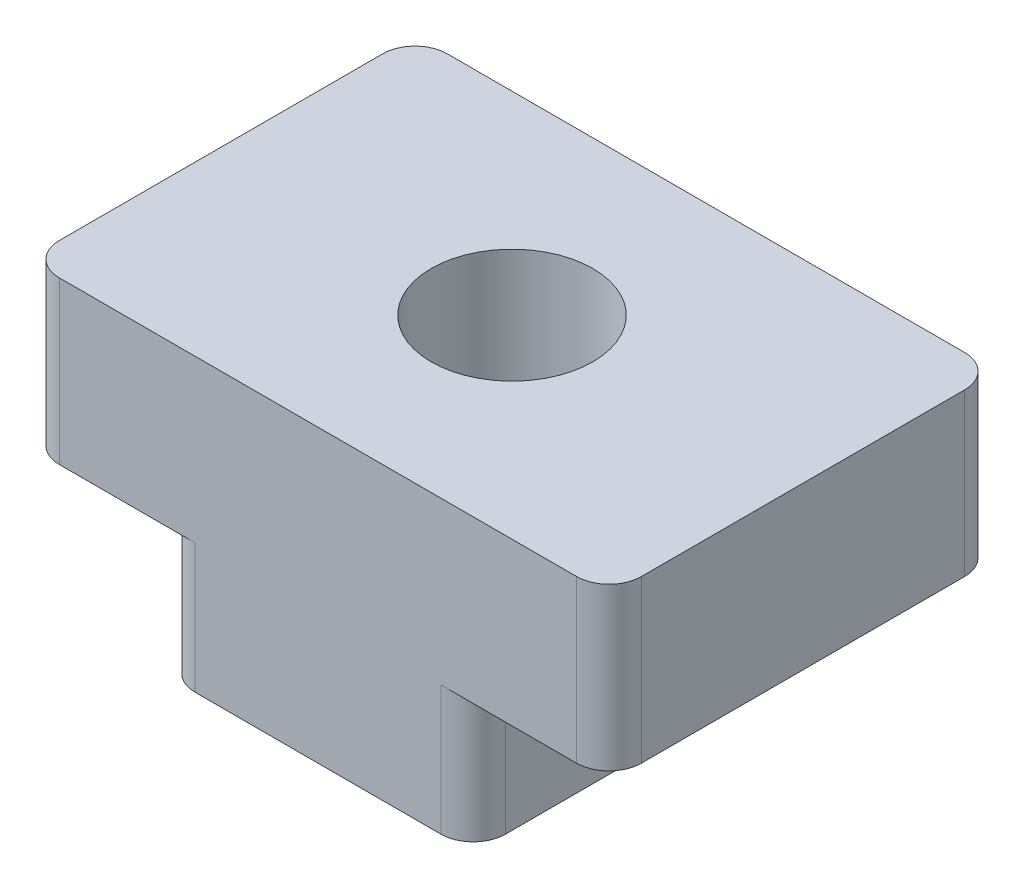
ISO-10303-21;
HEADER;
FILE_DESCRIPTION(('STEP AP214'),'2;1');
FILE_NAME('part.step','',(''),(''),'','','');
FILE_SCHEMA(('AUTOMOTIVE_DESIGN { 1 0 10303 214 1 1 1 1 }'));
ENDSEC;
DATA;
#1=APPLICATION_CONTEXT('core data for automotive mechanical design processes');
#2=APPLICATION_PROTOCOL_DEFINITION('international standard','automotive_design',2000,#1);
#3=PRODUCT_CONTEXT('',#1,'mechanical');
#4=PRODUCT('Part','Part','',(#3));
#5=PRODUCT_RELATED_PRODUCT_CATEGORY('part','',(#4));
#6=PRODUCT_DEFINITION_FORMATION('','',#4);
#7=PRODUCT_DEFINITION_CONTEXT('part definition',#1,'design');
#8=PRODUCT_DEFINITION('design','',#6,#7);
#9=PRODUCT_DEFINITION_SHAPE('','',#8);
#10=(LENGTH_UNIT() NAMED_UNIT(*) SI_UNIT(.MILLI.,.METRE.));
#11=(NAMED_UNIT(*) PLANE_ANGLE_UNIT() SI_UNIT($,.RADIAN.));
#12=(NAMED_UNIT(*) SI_UNIT($,.STERADIAN.) SOLID_ANGLE_UNIT());
#13=UNCERTAINTY_MEASURE_WITH_UNIT(LENGTH_MEASURE(1.E-05),#10,'distance_accuracy_value','');
#14=(GEOMETRIC_REPRESENTATION_CONTEXT(3) GLOBAL_UNCERTAINTY_ASSIGNED_CONTEXT((#13)) GLOBAL_UNIT_ASSIGNED_CONTEXT((#10,
#11,#12)) REPRESENTATION_CONTEXT('',''));
#15=CARTESIAN_POINT('',(0.,0.,0.));
#16=DIRECTION('',(0.,0.,1.));
#17=DIRECTION('',(1.,0.,0.));
#18=AXIS2_PLACEMENT_3D('',#15,#16,#17);
#19=CARTESIAN_POINT('',(4.5,0.,3.));
#20=DIRECTION('',(-1.,0.,0.));
#21=DIRECTION('',(0.,0.,1.));
#22=AXIS2_PLACEMENT_3D('',#19,#20,#21);
#23=PLANE('',#22);
#24=DIRECTION('',(0.,0.,-1.));
#25=VECTOR('',#24,1.);
#26=CARTESIAN_POINT('',(4.5,2.5,3.));
#27=LINE('',#26,#25);
#28=CARTESIAN_POINT('',(4.5,2.5,2.5));
#29=VERTEX_POINT('',#28);
#30=CARTESIAN_POINT('',(4.5,2.5,-2.5));
#31=VERTEX_POINT('',#30);
#32=EDGE_CURVE('E185',#29,#31,#27,.T.);
#33=ORIENTED_EDGE('',*,*,#32,.F.);
#34=DIRECTION('',(0.,1.,0.));
#35=VECTOR('',#34,1.);
#36=CARTESIAN_POINT('',(4.5,0.,2.5));
#37=LINE('',#36,#35);
#38=CARTESIAN_POINT('',(4.5,0.,2.5));
#39=VERTEX_POINT('',#38);
#40=EDGE_CURVE('E70',#29,#39,#37,.F.);
#41=ORIENTED_EDGE('',*,*,#40,.T.);
#42=DIRECTION('',(0.,0.,-1.));
#43=VECTOR('',#42,1.);
#44=CARTESIAN_POINT('',(4.5,0.,3.));
#45=LINE('',#44,#43);
#46=CARTESIAN_POINT('',(4.5,0.,-2.5));
#47=VERTEX_POINT('',#46);
#48=EDGE_CURVE('E213',#39,#47,#45,.T.);
#49=ORIENTED_EDGE('',*,*,#48,.T.);
#50=DIRECTION('',(0.,1.,0.));
#51=VECTOR('',#50,1.);
#52=CARTESIAN_POINT('',(4.5,2.5,-2.5));
#53=LINE('',#52,#51);
#54=EDGE_CURVE('E318',#47,#31,#53,.T.);
#55=ORIENTED_EDGE('',*,*,#54,.T.);
#56=EDGE_LOOP('',(#33,#41,#49,#55));
#57=FACE_BOUND('',#56,.T.);
#58=ADVANCED_FACE('F47',(#57),#23,.F.);
#59=CARTESIAN_POINT('',(-4.5,2.5,3.));
#60=DIRECTION('',(0.,-1.,0.));
#61=DIRECTION('',(0.,0.,-1.));
#62=AXIS2_PLACEMENT_3D('',#59,#60,#61);
#63=PLANE('',#62);
#64=CARTESIAN_POINT('',(0.,2.5,0.));
#65=DIRECTION('',(0.,1.,0.));
#66=DIRECTION('',(0.,0.,1.));
#67=AXIS2_PLACEMENT_3D('',#64,#65,#66);
#68=CIRCLE('',#67,1.25);
#69=CARTESIAN_POINT('',(0.,2.5,1.25));
#70=VERTEX_POINT('',#69);
#71=EDGE_CURVE('E205',#70,#70,#68,.T.);
#72=ORIENTED_EDGE('',*,*,#71,.F.);
#73=EDGE_LOOP('',(#72));
#74=FACE_BOUND('',#73,.T.);
#75=DIRECTION('',(0.,0.,-1.));
#76=VECTOR('',#75,1.);
#77=CARTESIAN_POINT('',(-4.5,2.5,3.));
#78=LINE('',#77,#76);
#79=CARTESIAN_POINT('',(-4.5,2.5,2.5));
#80=VERTEX_POINT('',#79);
#81=CARTESIAN_POINT('',(-4.5,2.5,-2.5));
#82=VERTEX_POINT('',#81);
#83=EDGE_CURVE('E246',#80,#82,#78,.T.);
#84=ORIENTED_EDGE('',*,*,#83,.F.);
#85=CARTESIAN_POINT('',(-4.,2.5,2.5));
#86=DIRECTION('',(0.,-1.,0.));
#87=DIRECTION('',(0.,0.,-1.));
#88=AXIS2_PLACEMENT_3D('',#85,#86,#87);
#89=CIRCLE('',#88,0.5);
#90=CARTESIAN_POINT('',(-4.,2.5,3.));
#91=VERTEX_POINT('',#90);
#92=EDGE_CURVE('E190',#80,#91,#89,.F.);
#93=ORIENTED_EDGE('',*,*,#92,.T.);
#94=DIRECTION('',(-1.,0.,0.));
#95=VECTOR('',#94,1.);
#96=CARTESIAN_POINT('',(-4.5,2.5,3.));
#97=LINE('',#96,#95);
#98=CARTESIAN_POINT('',(4.,2.5,3.));
#99=VERTEX_POINT('',#98);
#100=EDGE_CURVE('E179',#99,#91,#97,.T.);
#101=ORIENTED_EDGE('',*,*,#100,.F.);
#102=CARTESIAN_POINT('',(4.,2.5,2.5));
#103=DIRECTION('',(0.,-1.,0.));
#104=DIRECTION('',(0.,0.,-1.));
#105=AXIS2_PLACEMENT_3D('',#102,#103,#104);
#106=CIRCLE('',#105,0.5);
#107=EDGE_CURVE('E162',#99,#29,#106,.F.);
#108=ORIENTED_EDGE('',*,*,#107,.T.);
#109=ORIENTED_EDGE('',*,*,#32,.T.);
#110=CARTESIAN_POINT('',(4.,2.5,-2.5));
#111=DIRECTION('',(0.,-1.,0.));
#112=DIRECTION('',(0.,0.,-1.));
#113=AXIS2_PLACEMENT_3D('',#110,#111,#112);
#114=CIRCLE('',#113,0.5);
#115=CARTESIAN_POINT('',(4.,2.5,-3.));
#116=VERTEX_POINT('',#115);
#117=EDGE_CURVE('E172',#31,#116,#114,.F.);
#118=ORIENTED_EDGE('',*,*,#117,.T.);
#119=DIRECTION('',(-1.,0.,0.));
#120=VECTOR('',#119,1.);
#121=CARTESIAN_POINT('',(-4.5,2.5,-3.));
#122=LINE('',#121,#120);
#123=CARTESIAN_POINT('',(-4.,2.5,-3.));
#124=VERTEX_POINT('',#123);
#125=EDGE_CURVE('E214',#116,#124,#122,.T.);
#126=ORIENTED_EDGE('',*,*,#125,.T.);
#127=CARTESIAN_POINT('',(-4.,2.5,-2.5));
#128=DIRECTION('',(0.,-1.,0.));
#129=DIRECTION('',(0.,0.,-1.));
#130=AXIS2_PLACEMENT_3D('',#127,#128,#129);
#131=CIRCLE('',#130,0.5);
#132=EDGE_CURVE('E171',#124,#82,#131,.F.);
#133=ORIENTED_EDGE('',*,*,#132,.T.);
#134=EDGE_LOOP('',(#84,#93,#101,#108,#109,#118,#126,#133));
#135=FACE_BOUND('',#134,.T.);
#136=ADVANCED_FACE('F188',(#74,#135),#63,.F.);
#137=CARTESIAN_POINT('',(-4.5,0.,3.));
#138=DIRECTION('',(1.,0.,0.));
#139=DIRECTION('',(0.,0.,-1.));
#140=AXIS2_PLACEMENT_3D('',#137,#138,#139);
#141=PLANE('',#140);
#142=DIRECTION('',(0.,0.,-1.));
#143=VECTOR('',#142,1.);
#144=CARTESIAN_POINT('',(-4.5,0.,3.));
#145=LINE('',#144,#143);
#146=CARTESIAN_POINT('',(-4.5,0.,2.5));
#147=VERTEX_POINT('',#146);
#148=CARTESIAN_POINT('',(-4.5,0.,-2.5));
#149=VERTEX_POINT('',#148);
#150=EDGE_CURVE('E242',#147,#149,#145,.T.);
#151=ORIENTED_EDGE('',*,*,#150,.F.);
#152=DIRECTION('',(0.,-1.,0.));
#153=VECTOR('',#152,1.);
#154=CARTESIAN_POINT('',(-4.5,0.,2.5));
#155=LINE('',#154,#153);
#156=EDGE_CURVE('E270',#147,#80,#155,.F.);
#157=ORIENTED_EDGE('',*,*,#156,.T.);
#158=ORIENTED_EDGE('',*,*,#83,.T.);
#159=DIRECTION('',(0.,-1.,0.));
#160=VECTOR('',#159,1.);
#161=CARTESIAN_POINT('',(-4.5,0.,-2.5));
#162=LINE('',#161,#160);
#163=EDGE_CURVE('E266',#82,#149,#162,.T.);
#164=ORIENTED_EDGE('',*,*,#163,.T.);
#165=EDGE_LOOP('',(#151,#157,#158,#164));
#166=FACE_BOUND('',#165,.T.);
#167=ADVANCED_FACE('F380',(#166),#141,.F.);
#168=CARTESIAN_POINT('',(-4.5,0.,3.));
#169=DIRECTION('',(0.,1.,0.));
#170=DIRECTION('',(-1.,0.,0.));
#171=AXIS2_PLACEMENT_3D('',#168,#169,#170);
#172=PLANE('',#171);
#173=DIRECTION('',(1.,0.,0.));
#174=VECTOR('',#173,1.);
#175=CARTESIAN_POINT('',(-4.5,0.,3.));
#176=LINE('',#175,#174);
#177=CARTESIAN_POINT('',(-4.,0.,3.));
#178=VERTEX_POINT('',#177);
#179=CARTESIAN_POINT('',(-1.9,0.,3.));
#180=VERTEX_POINT('',#179);
#181=EDGE_CURVE('E192',#178,#180,#176,.T.);
#182=ORIENTED_EDGE('',*,*,#181,.F.);
#183=CARTESIAN_POINT('',(-4.,0.,2.5));
#184=DIRECTION('',(0.,1.,0.));
#185=DIRECTION('',(-1.,0.,0.));
#186=AXIS2_PLACEMENT_3D('',#183,#184,#185);
#187=CIRCLE('',#186,0.5);
#188=EDGE_CURVE('E263',#178,#147,#187,.F.);
#189=ORIENTED_EDGE('',*,*,#188,.T.);
#190=ORIENTED_EDGE('',*,*,#150,.T.);
#191=CARTESIAN_POINT('',(-4.,0.,-2.5));
#192=DIRECTION('',(0.,1.,0.));
#193=DIRECTION('',(-1.,0.,0.));
#194=AXIS2_PLACEMENT_3D('',#191,#192,#193);
#195=CIRCLE('',#194,0.5);
#196=CARTESIAN_POINT('',(-4.,0.,-3.));
#197=VERTEX_POINT('',#196);
#198=EDGE_CURVE('E260',#149,#197,#195,.F.);
#199=ORIENTED_EDGE('',*,*,#198,.T.);
#200=DIRECTION('',(1.,0.,0.));
#201=VECTOR('',#200,1.);
#202=CARTESIAN_POINT('',(-4.5,0.,-3.));
#203=LINE('',#202,#201);
#204=CARTESIAN_POINT('',(-1.9,0.,-3.));
#205=VERTEX_POINT('',#204);
#206=EDGE_CURVE('E218',#197,#205,#203,.T.);
#207=ORIENTED_EDGE('',*,*,#206,.T.);
#208=CARTESIAN_POINT('',(-1.9,0.,-2.5));
#209=DIRECTION('',(0.,1.,0.));
#210=DIRECTION('',(-1.,0.,0.));
#211=AXIS2_PLACEMENT_3D('',#208,#209,#210);
#212=CIRCLE('',#211,0.5);
#213=CARTESIAN_POINT('',(-2.4,0.,-2.5));
#214=VERTEX_POINT('',#213);
#215=EDGE_CURVE('E56',#205,#214,#212,.T.);
#216=ORIENTED_EDGE('',*,*,#215,.T.);
#217=DIRECTION('',(0.,0.,-1.));
#218=VECTOR('',#217,1.);
#219=CARTESIAN_POINT('',(-2.4,0.,3.));
#220=LINE('',#219,#218);
#221=CARTESIAN_POINT('',(-2.4,0.,2.5));
#222=VERTEX_POINT('',#221);
#223=EDGE_CURVE('E238',#222,#214,#220,.T.);
#224=ORIENTED_EDGE('',*,*,#223,.F.);
#225=CARTESIAN_POINT('',(-1.9,0.,2.5));
#226=DIRECTION('',(0.,1.,0.));
#227=DIRECTION('',(-1.,0.,0.));
#228=AXIS2_PLACEMENT_3D('',#225,#226,#227);
#229=CIRCLE('',#228,0.5);
#230=EDGE_CURVE('E329',#222,#180,#229,.T.);
#231=ORIENTED_EDGE('',*,*,#230,.T.);
#232=EDGE_LOOP('',(#182,#189,#190,#199,#207,#216,#224,#231));
#233=FACE_BOUND('',#232,.T.);
#234=ADVANCED_FACE('F341',(#233),#172,.F.);
#235=CARTESIAN_POINT('',(-2.4,0.,3.));
#236=DIRECTION('',(1.,0.,0.));
#237=DIRECTION('',(0.,1.,0.));
#238=AXIS2_PLACEMENT_3D('',#235,#236,#237);
#239=PLANE('',#238);
#240=DIRECTION('',(0.,0.,-1.));
#241=VECTOR('',#240,1.);
#242=CARTESIAN_POINT('',(-2.4,-2.,3.));
#243=LINE('',#242,#241);
#244=CARTESIAN_POINT('',(-2.4,-2.,2.5));
#245=VERTEX_POINT('',#244);
#246=CARTESIAN_POINT('',(-2.4,-2.,-2.5));
#247=VERTEX_POINT('',#246);
#248=EDGE_CURVE('E234',#245,#247,#243,.T.);
#249=ORIENTED_EDGE('',*,*,#248,.F.);
#250=DIRECTION('',(0.,-1.,0.));
#251=VECTOR('',#250,1.);
#252=CARTESIAN_POINT('',(-2.4,0.,2.5));
#253=LINE('',#252,#251);
#254=EDGE_CURVE('E295',#245,#222,#253,.F.);
#255=ORIENTED_EDGE('',*,*,#254,.T.);
#256=ORIENTED_EDGE('',*,*,#223,.T.);
#257=DIRECTION('',(0.,-1.,0.));
#258=VECTOR('',#257,1.);
#259=CARTESIAN_POINT('',(-2.4,-2.,-2.5));
#260=LINE('',#259,#258);
#261=EDGE_CURVE('E291',#214,#247,#260,.T.);
#262=ORIENTED_EDGE('',*,*,#261,.T.);
#263=EDGE_LOOP('',(#249,#255,#256,#262));
#264=FACE_BOUND('',#263,.T.);
#265=ADVANCED_FACE('F349',(#264),#239,.F.);
#266=CARTESIAN_POINT('',(-2.4,-2.,3.));
#267=DIRECTION('',(0.,1.,0.));
#268=DIRECTION('',(-1.,0.,0.));
#269=AXIS2_PLACEMENT_3D('',#266,#267,#268);
#270=PLANE('',#269);
#271=CARTESIAN_POINT('',(0.,-2.,0.));
#272=DIRECTION('',(0.,1.,0.));
#273=DIRECTION('',(0.,0.,1.));
#274=AXIS2_PLACEMENT_3D('',#271,#272,#273);
#275=CIRCLE('',#274,1.25);
#276=CARTESIAN_POINT('',(0.,-2.,1.25));
#277=VERTEX_POINT('',#276);
#278=EDGE_CURVE('E219',#277,#277,#275,.T.);
#279=ORIENTED_EDGE('',*,*,#278,.T.);
#280=EDGE_LOOP('',(#279));
#281=FACE_BOUND('',#280,.T.);
#282=DIRECTION('',(1.,0.,0.));
#283=VECTOR('',#282,1.);
#284=CARTESIAN_POINT('',(-2.4,-2.,3.));
#285=LINE('',#284,#283);
#286=CARTESIAN_POINT('',(-1.9,-2.,3.));
#287=VERTEX_POINT('',#286);
#288=CARTESIAN_POINT('',(1.9,-2.,3.));
#289=VERTEX_POINT('',#288);
#290=EDGE_CURVE('E199',#287,#289,#285,.T.);
#291=ORIENTED_EDGE('',*,*,#290,.F.);
#292=CARTESIAN_POINT('',(-1.9,-2.,2.5));
#293=DIRECTION('',(0.,1.,0.));
#294=DIRECTION('',(-1.,0.,0.));
#295=AXIS2_PLACEMENT_3D('',#292,#293,#294);
#296=CIRCLE('',#295,0.5);
#297=EDGE_CURVE('E288',#287,#245,#296,.F.);
#298=ORIENTED_EDGE('',*,*,#297,.T.);
#299=ORIENTED_EDGE('',*,*,#248,.T.);
#300=CARTESIAN_POINT('',(-1.9,-2.,-2.5));
#301=DIRECTION('',(0.,1.,0.));
#302=DIRECTION('',(-1.,0.,0.));
#303=AXIS2_PLACEMENT_3D('',#300,#301,#302);
#304=CIRCLE('',#303,0.5);
#305=CARTESIAN_POINT('',(-1.9,-2.,-3.));
#306=VERTEX_POINT('',#305);
#307=EDGE_CURVE('E282',#247,#306,#304,.F.);
#308=ORIENTED_EDGE('',*,*,#307,.T.);
#309=DIRECTION('',(1.,0.,0.));
#310=VECTOR('',#309,1.);
#311=CARTESIAN_POINT('',(-2.4,-2.,-3.));
#312=LINE('',#311,#310);
#313=CARTESIAN_POINT('',(1.9,-2.,-3.));
#314=VERTEX_POINT('',#313);
#315=EDGE_CURVE('E202',#306,#314,#312,.T.);
#316=ORIENTED_EDGE('',*,*,#315,.T.);
#317=CARTESIAN_POINT('',(1.9,-2.,-2.5));
#318=DIRECTION('',(0.,1.,0.));
#319=DIRECTION('',(-1.,0.,0.));
#320=AXIS2_PLACEMENT_3D('',#317,#318,#319);
#321=CIRCLE('',#320,0.5);
#322=CARTESIAN_POINT('',(2.4,-2.,-2.5));
#323=VERTEX_POINT('',#322);
#324=EDGE_CURVE('E279',#314,#323,#321,.F.);
#325=ORIENTED_EDGE('',*,*,#324,.T.);
#326=DIRECTION('',(0.,0.,-1.));
#327=VECTOR('',#326,1.);
#328=CARTESIAN_POINT('',(2.4,-2.,3.));
#329=LINE('',#328,#327);
#330=CARTESIAN_POINT('',(2.4,-2.,2.5));
#331=VERTEX_POINT('',#330);
#332=EDGE_CURVE('E230',#331,#323,#329,.T.);
#333=ORIENTED_EDGE('',*,*,#332,.F.);
#334=CARTESIAN_POINT('',(1.9,-2.,2.5));
#335=DIRECTION('',(0.,1.,0.));
#336=DIRECTION('',(-1.,0.,0.));
#337=AXIS2_PLACEMENT_3D('',#334,#335,#336);
#338=CIRCLE('',#337,0.5);
#339=EDGE_CURVE('E285',#331,#289,#338,.F.);
#340=ORIENTED_EDGE('',*,*,#339,.T.);
#341=EDGE_LOOP('',(#291,#298,#299,#308,#316,#325,#333,#340));
#342=FACE_BOUND('',#341,.T.);
#343=ADVANCED_FACE('F355',(#281,#342),#270,.F.);
#344=CARTESIAN_POINT('',(2.4,0.,3.));
#345=DIRECTION('',(-1.,0.,0.));
#346=DIRECTION('',(0.,-1.,0.));
#347=AXIS2_PLACEMENT_3D('',#344,#345,#346);
#348=PLANE('',#347);
#349=DIRECTION('',(0.,0.,-1.));
#350=VECTOR('',#349,1.);
#351=CARTESIAN_POINT('',(2.4,0.,3.));
#352=LINE('',#351,#350);
#353=CARTESIAN_POINT('',(2.4,0.,2.5));
#354=VERTEX_POINT('',#353);
#355=CARTESIAN_POINT('',(2.4,0.,-2.5));
#356=VERTEX_POINT('',#355);
#357=EDGE_CURVE('E226',#354,#356,#352,.T.);
#358=ORIENTED_EDGE('',*,*,#357,.F.);
#359=DIRECTION('',(0.,1.,0.));
#360=VECTOR('',#359,1.);
#361=CARTESIAN_POINT('',(2.4,0.,2.5));
#362=LINE('',#361,#360);
#363=EDGE_CURVE('E302',#354,#331,#362,.F.);
#364=ORIENTED_EDGE('',*,*,#363,.T.);
#365=ORIENTED_EDGE('',*,*,#332,.T.);
#366=DIRECTION('',(0.,1.,0.));
#367=VECTOR('',#366,1.);
#368=CARTESIAN_POINT('',(2.4,0.,-2.5));
#369=LINE('',#368,#367);
#370=EDGE_CURVE('E298',#323,#356,#369,.T.);
#371=ORIENTED_EDGE('',*,*,#370,.T.);
#372=EDGE_LOOP('',(#358,#364,#365,#371));
#373=FACE_BOUND('',#372,.T.);
#374=ADVANCED_FACE('F367',(#373),#348,.F.);
#375=CARTESIAN_POINT('',(4.5,0.,3.));
#376=DIRECTION('',(0.,1.,0.));
#377=DIRECTION('',(-1.,0.,0.));
#378=AXIS2_PLACEMENT_3D('',#375,#376,#377);
#379=PLANE('',#378);
#380=ORIENTED_EDGE('',*,*,#48,.F.);
#381=CARTESIAN_POINT('',(4.,0.,2.5));
#382=DIRECTION('',(0.,1.,0.));
#383=DIRECTION('',(-1.,0.,0.));
#384=AXIS2_PLACEMENT_3D('',#381,#382,#383);
#385=CIRCLE('',#384,0.5);
#386=CARTESIAN_POINT('',(4.,0.,3.));
#387=VERTEX_POINT('',#386);
#388=EDGE_CURVE('E326',#39,#387,#385,.F.);
#389=ORIENTED_EDGE('',*,*,#388,.T.);
#390=DIRECTION('',(1.,0.,0.));
#391=VECTOR('',#390,1.);
#392=CARTESIAN_POINT('',(4.5,0.,3.));
#393=LINE('',#392,#391);
#394=CARTESIAN_POINT('',(1.9,0.,3.));
#395=VERTEX_POINT('',#394);
#396=EDGE_CURVE('E182',#395,#387,#393,.T.);
#397=ORIENTED_EDGE('',*,*,#396,.F.);
#398=CARTESIAN_POINT('',(1.9,0.,2.5));
#399=DIRECTION('',(0.,1.,0.));
#400=DIRECTION('',(-1.,0.,0.));
#401=AXIS2_PLACEMENT_3D('',#398,#399,#400);
#402=CIRCLE('',#401,0.5);
#403=EDGE_CURVE('E333',#395,#354,#402,.T.);
#404=ORIENTED_EDGE('',*,*,#403,.T.);
#405=ORIENTED_EDGE('',*,*,#357,.T.);
#406=CARTESIAN_POINT('',(1.9,0.,-2.5));
#407=DIRECTION('',(0.,1.,0.));
#408=DIRECTION('',(-1.,0.,0.));
#409=AXIS2_PLACEMENT_3D('',#406,#407,#408);
#410=CIRCLE('',#409,0.5);
#411=CARTESIAN_POINT('',(1.9,0.,-3.));
#412=VERTEX_POINT('',#411);
#413=EDGE_CURVE('E11',#356,#412,#410,.T.);
#414=ORIENTED_EDGE('',*,*,#413,.T.);
#415=DIRECTION('',(1.,0.,0.));
#416=VECTOR('',#415,1.);
#417=CARTESIAN_POINT('',(4.5,0.,-3.));
#418=LINE('',#417,#416);
#419=CARTESIAN_POINT('',(4.,0.,-3.));
#420=VERTEX_POINT('',#419);
#421=EDGE_CURVE('E193',#412,#420,#418,.T.);
#422=ORIENTED_EDGE('',*,*,#421,.T.);
#423=CARTESIAN_POINT('',(4.,0.,-2.5));
#424=DIRECTION('',(0.,1.,0.));
#425=DIRECTION('',(-1.,0.,0.));
#426=AXIS2_PLACEMENT_3D('',#423,#424,#425);
#427=CIRCLE('',#426,0.5);
#428=EDGE_CURVE('E63',#420,#47,#427,.F.);
#429=ORIENTED_EDGE('',*,*,#428,.T.);
#430=EDGE_LOOP('',(#380,#389,#397,#404,#405,#414,#422,#429));
#431=FACE_BOUND('',#430,.T.);
#432=ADVANCED_FACE('F412',(#431),#379,.F.);
#433=CARTESIAN_POINT('',(0.,0.,3.));
#434=DIRECTION('',(0.,0.,-1.));
#435=DIRECTION('',(-1.,0.,0.));
#436=AXIS2_PLACEMENT_3D('',#433,#434,#435);
#437=PLANE('',#436);
#438=ORIENTED_EDGE('',*,*,#100,.T.);
#439=DIRECTION('',(0.,-1.,0.));
#440=VECTOR('',#439,1.);
#441=CARTESIAN_POINT('',(-4.,0.,3.));
#442=LINE('',#441,#440);
#443=EDGE_CURVE('E257',#91,#178,#442,.T.);
#444=ORIENTED_EDGE('',*,*,#443,.T.);
#445=ORIENTED_EDGE('',*,*,#181,.T.);
#446=DIRECTION('',(0.,-1.,0.));
#447=VECTOR('',#446,1.);
#448=CARTESIAN_POINT('',(-1.9,0.,3.));
#449=LINE('',#448,#447);
#450=EDGE_CURVE('E253',#180,#287,#449,.T.);
#451=ORIENTED_EDGE('',*,*,#450,.T.);
#452=ORIENTED_EDGE('',*,*,#290,.T.);
#453=DIRECTION('',(0.,1.,0.));
#454=VECTOR('',#453,1.);
#455=CARTESIAN_POINT('',(1.9,0.,3.));
#456=LINE('',#455,#454);
#457=EDGE_CURVE('E184',#289,#395,#456,.T.);
#458=ORIENTED_EDGE('',*,*,#457,.T.);
#459=ORIENTED_EDGE('',*,*,#396,.T.);
#460=DIRECTION('',(0.,1.,0.));
#461=VECTOR('',#460,1.);
#462=CARTESIAN_POINT('',(4.,0.,3.));
#463=LINE('',#462,#461);
#464=EDGE_CURVE('E166',#387,#99,#463,.T.);
#465=ORIENTED_EDGE('',*,*,#464,.T.);
#466=EDGE_LOOP('',(#438,#444,#445,#451,#452,#458,#459,#465));
#467=FACE_BOUND('',#466,.T.);
#468=ADVANCED_FACE('F177',(#467),#437,.F.);
#469=CARTESIAN_POINT('',(0.,0.,-3.));
#470=DIRECTION('',(0.,0.,-1.));
#471=DIRECTION('',(-1.,0.,0.));
#472=AXIS2_PLACEMENT_3D('',#469,#470,#471);
#473=PLANE('',#472);
#474=ORIENTED_EDGE('',*,*,#315,.F.);
#475=DIRECTION('',(0.,-1.,0.));
#476=VECTOR('',#475,1.);
#477=CARTESIAN_POINT('',(-1.9,0.,-3.));
#478=LINE('',#477,#476);
#479=EDGE_CURVE('E314',#306,#205,#478,.F.);
#480=ORIENTED_EDGE('',*,*,#479,.T.);
#481=ORIENTED_EDGE('',*,*,#206,.F.);
#482=DIRECTION('',(0.,-1.,0.));
#483=VECTOR('',#482,1.);
#484=CARTESIAN_POINT('',(-4.,2.5,-3.));
#485=LINE('',#484,#483);
#486=EDGE_CURVE('E308',#197,#124,#485,.F.);
#487=ORIENTED_EDGE('',*,*,#486,.T.);
#488=ORIENTED_EDGE('',*,*,#125,.F.);
#489=DIRECTION('',(0.,1.,0.));
#490=VECTOR('',#489,1.);
#491=CARTESIAN_POINT('',(4.,0.,-3.));
#492=LINE('',#491,#490);
#493=EDGE_CURVE('E305',#116,#420,#492,.F.);
#494=ORIENTED_EDGE('',*,*,#493,.T.);
#495=ORIENTED_EDGE('',*,*,#421,.F.);
#496=DIRECTION('',(0.,1.,0.));
#497=VECTOR('',#496,1.);
#498=CARTESIAN_POINT('',(1.9,-2.,-3.));
#499=LINE('',#498,#497);
#500=EDGE_CURVE('E311',#412,#314,#499,.F.);
#501=ORIENTED_EDGE('',*,*,#500,.T.);
#502=EDGE_LOOP('',(#474,#480,#481,#487,#488,#494,#495,#501));
#503=FACE_BOUND('',#502,.T.);
#504=ADVANCED_FACE('F358',(#503),#473,.T.);
#505=CARTESIAN_POINT('',(0.,-2.,0.));
#506=DIRECTION('',(0.,1.,0.));
#507=DIRECTION('',(0.,0.,1.));
#508=AXIS2_PLACEMENT_3D('',#505,#506,#507);
#509=CYLINDRICAL_SURFACE('',#508,1.25);
#510=ORIENTED_EDGE('',*,*,#278,.F.);
#511=EDGE_LOOP('',(#510));
#512=FACE_BOUND('',#511,.T.);
#513=ORIENTED_EDGE('',*,*,#71,.T.);
#514=EDGE_LOOP('',(#513));
#515=FACE_BOUND('',#514,.T.);
#516=ADVANCED_FACE('F384',(#512,#515),#509,.F.);
#517=CARTESIAN_POINT('',(-4.,0.,2.5));
#518=DIRECTION('',(0.,-1.,0.));
#519=DIRECTION('',(0.,0.,-1.));
#520=AXIS2_PLACEMENT_3D('',#517,#518,#519);
#521=CYLINDRICAL_SURFACE('',#520,0.5);
#522=ORIENTED_EDGE('',*,*,#92,.F.);
#523=ORIENTED_EDGE('',*,*,#156,.F.);
#524=ORIENTED_EDGE('',*,*,#188,.F.);
#525=ORIENTED_EDGE('',*,*,#443,.F.);
#526=EDGE_LOOP('',(#522,#523,#524,#525));
#527=FACE_BOUND('',#526,.T.);
#528=ADVANCED_FACE('F382',(#527),#521,.T.);
#529=CARTESIAN_POINT('',(-1.9,0.,2.5));
#530=DIRECTION('',(0.,-1.,0.));
#531=DIRECTION('',(1.,0.,0.));
#532=AXIS2_PLACEMENT_3D('',#529,#530,#531);
#533=CYLINDRICAL_SURFACE('',#532,0.5);
#534=ORIENTED_EDGE('',*,*,#230,.F.);
#535=ORIENTED_EDGE('',*,*,#254,.F.);
#536=ORIENTED_EDGE('',*,*,#297,.F.);
#537=ORIENTED_EDGE('',*,*,#450,.F.);
#538=EDGE_LOOP('',(#534,#535,#536,#537));
#539=FACE_BOUND('',#538,.T.);
#540=ADVANCED_FACE('F375',(#539),#533,.T.);
#541=CARTESIAN_POINT('',(1.9,0.,2.5));
#542=DIRECTION('',(0.,1.,0.));
#543=DIRECTION('',(-1.,0.,0.));
#544=AXIS2_PLACEMENT_3D('',#541,#542,#543);
#545=CYLINDRICAL_SURFACE('',#544,0.5);
#546=ORIENTED_EDGE('',*,*,#339,.F.);
#547=ORIENTED_EDGE('',*,*,#363,.F.);
#548=ORIENTED_EDGE('',*,*,#403,.F.);
#549=ORIENTED_EDGE('',*,*,#457,.F.);
#550=EDGE_LOOP('',(#546,#547,#548,#549));
#551=FACE_BOUND('',#550,.T.);
#552=ADVANCED_FACE('F371',(#551),#545,.T.);
#553=CARTESIAN_POINT('',(-1.9,0.,-2.5));
#554=DIRECTION('',(0.,1.,0.));
#555=DIRECTION('',(-1.,0.,0.));
#556=AXIS2_PLACEMENT_3D('',#553,#554,#555);
#557=CYLINDRICAL_SURFACE('',#556,0.5);
#558=ORIENTED_EDGE('',*,*,#215,.F.);
#559=ORIENTED_EDGE('',*,*,#479,.F.);
#560=ORIENTED_EDGE('',*,*,#307,.F.);
#561=ORIENTED_EDGE('',*,*,#261,.F.);
#562=EDGE_LOOP('',(#558,#559,#560,#561));
#563=FACE_BOUND('',#562,.T.);
#564=ADVANCED_FACE('F351',(#563),#557,.T.);
#565=CARTESIAN_POINT('',(1.9,0.,-2.5));
#566=DIRECTION('',(0.,-1.,0.));
#567=DIRECTION('',(1.,0.,0.));
#568=AXIS2_PLACEMENT_3D('',#565,#566,#567);
#569=CYLINDRICAL_SURFACE('',#568,0.5);
#570=ORIENTED_EDGE('',*,*,#324,.F.);
#571=ORIENTED_EDGE('',*,*,#500,.F.);
#572=ORIENTED_EDGE('',*,*,#413,.F.);
#573=ORIENTED_EDGE('',*,*,#370,.F.);
#574=EDGE_LOOP('',(#570,#571,#572,#573));
#575=FACE_BOUND('',#574,.T.);
#576=ADVANCED_FACE('F361',(#575),#569,.T.);
#577=CARTESIAN_POINT('',(-4.,0.,-2.5));
#578=DIRECTION('',(0.,1.,0.));
#579=DIRECTION('',(0.,0.,1.));
#580=AXIS2_PLACEMENT_3D('',#577,#578,#579);
#581=CYLINDRICAL_SURFACE('',#580,0.5);
#582=ORIENTED_EDGE('',*,*,#132,.F.);
#583=ORIENTED_EDGE('',*,*,#486,.F.);
#584=ORIENTED_EDGE('',*,*,#198,.F.);
#585=ORIENTED_EDGE('',*,*,#163,.F.);
#586=EDGE_LOOP('',(#582,#583,#584,#585));
#587=FACE_BOUND('',#586,.T.);
#588=ADVANCED_FACE('F458',(#587),#581,.T.);
#589=CARTESIAN_POINT('',(4.,0.,2.5));
#590=DIRECTION('',(0.,1.,0.));
#591=DIRECTION('',(0.,0.,1.));
#592=AXIS2_PLACEMENT_3D('',#589,#590,#591);
#593=CYLINDRICAL_SURFACE('',#592,0.5);
#594=ORIENTED_EDGE('',*,*,#388,.F.);
#595=ORIENTED_EDGE('',*,*,#40,.F.);
#596=ORIENTED_EDGE('',*,*,#107,.F.);
#597=ORIENTED_EDGE('',*,*,#464,.F.);
#598=EDGE_LOOP('',(#594,#595,#596,#597));
#599=FACE_BOUND('',#598,.T.);
#600=ADVANCED_FACE('F165',(#599),#593,.T.);
#601=CARTESIAN_POINT('',(4.,0.,-2.5));
#602=DIRECTION('',(0.,-1.,0.));
#603=DIRECTION('',(0.,0.,-1.));
#604=AXIS2_PLACEMENT_3D('',#601,#602,#603);
#605=CYLINDRICAL_SURFACE('',#604,0.5);
#606=ORIENTED_EDGE('',*,*,#428,.F.);
#607=ORIENTED_EDGE('',*,*,#493,.F.);
#608=ORIENTED_EDGE('',*,*,#117,.F.);
#609=ORIENTED_EDGE('',*,*,#54,.F.);
#610=EDGE_LOOP('',(#606,#607,#608,#609));
#611=FACE_BOUND('',#610,.T.);
#612=ADVANCED_FACE('F49',(#611),#605,.T.);
#613=CLOSED_SHELL('',(#58,#136,#167,#234,#265,#343,#374,#432,#468,#504,#516,#528,#540,#552,#564,
#576,#588,#600,#612));
#614=MANIFOLD_SOLID_BREP('B2',#613);
#615=ADVANCED_BREP_SHAPE_REPRESENTATION('',(#18,#614),#14);
#616=SHAPE_DEFINITION_REPRESENTATION(#9,#615);
ENDSEC;
END-ISO-10303-21;
